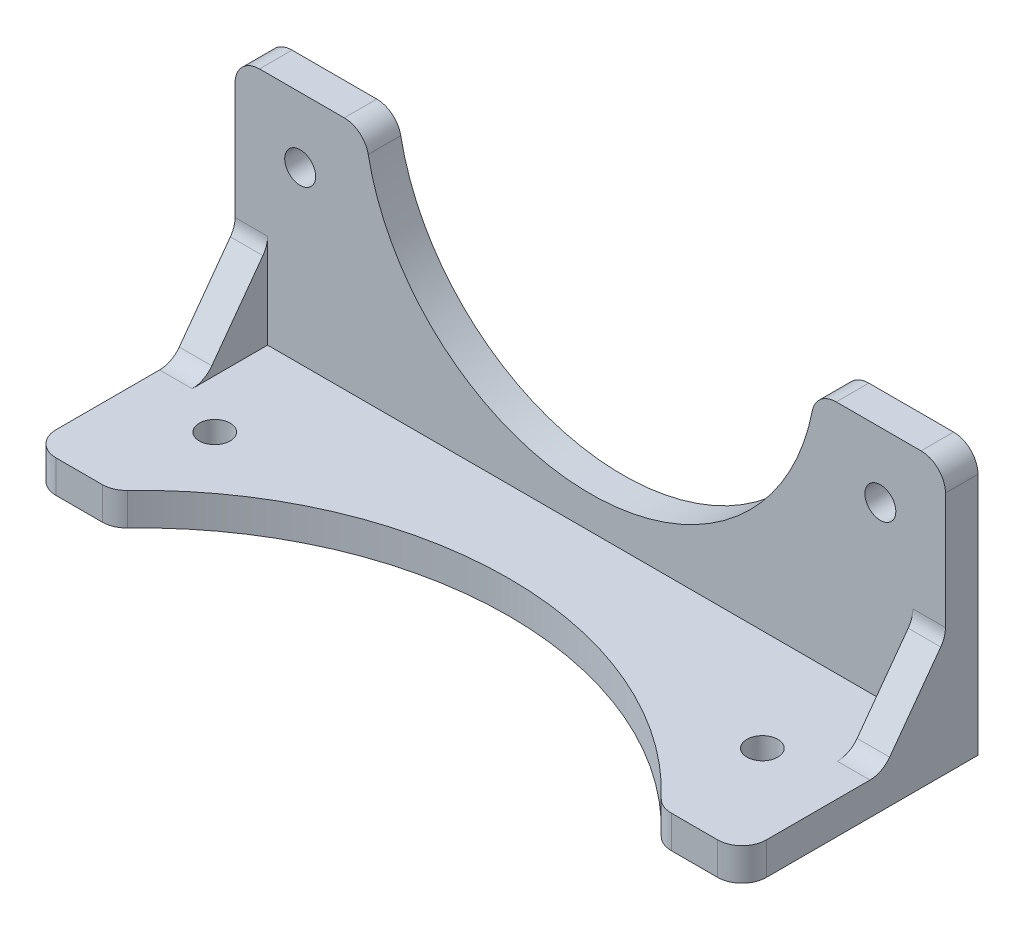
ISO-10303-21;
HEADER;
FILE_DESCRIPTION(('STEP AP214'),'2;1');
FILE_NAME('part.step','',(''),(''),'','','');
FILE_SCHEMA(('AUTOMOTIVE_DESIGN { 1 0 10303 214 1 1 1 1 }'));
ENDSEC;
DATA;
#1=APPLICATION_CONTEXT('core data for automotive mechanical design processes');
#2=APPLICATION_PROTOCOL_DEFINITION('international standard','automotive_design',2000,#1);
#3=PRODUCT_CONTEXT('',#1,'mechanical');
#4=PRODUCT('Part','Part','',(#3));
#5=PRODUCT_RELATED_PRODUCT_CATEGORY('part','',(#4));
#6=PRODUCT_DEFINITION_FORMATION('','',#4);
#7=PRODUCT_DEFINITION_CONTEXT('part definition',#1,'design');
#8=PRODUCT_DEFINITION('design','',#6,#7);
#9=PRODUCT_DEFINITION_SHAPE('','',#8);
#10=(LENGTH_UNIT() NAMED_UNIT(*) SI_UNIT(.MILLI.,.METRE.));
#11=(NAMED_UNIT(*) PLANE_ANGLE_UNIT() SI_UNIT($,.RADIAN.));
#12=(NAMED_UNIT(*) SI_UNIT($,.STERADIAN.) SOLID_ANGLE_UNIT());
#13=UNCERTAINTY_MEASURE_WITH_UNIT(LENGTH_MEASURE(1.E-05),#10,'distance_accuracy_value','');
#14=(GEOMETRIC_REPRESENTATION_CONTEXT(3) GLOBAL_UNCERTAINTY_ASSIGNED_CONTEXT((#13)) GLOBAL_UNIT_ASSIGNED_CONTEXT((#10,
#11,#12)) REPRESENTATION_CONTEXT('',''));
#15=CARTESIAN_POINT('',(0.,0.,0.));
#16=DIRECTION('',(0.,0.,1.));
#17=DIRECTION('',(1.,0.,0.));
#18=AXIS2_PLACEMENT_3D('',#15,#16,#17);
#19=CARTESIAN_POINT('',(0.,7.68566769527791,4.));
#20=DIRECTION('',(0.,0.,1.));
#21=DIRECTION('',(1.,0.,0.));
#22=AXIS2_PLACEMENT_3D('',#19,#20,#21);
#23=PLANE('',#22);
#24=CARTESIAN_POINT('',(35.65,-3.21618973444082,4.));
#25=DIRECTION('',(0.,0.,1.));
#26=DIRECTION('',(1.,0.,0.));
#27=AXIS2_PLACEMENT_3D('',#24,#25,#26);
#28=CIRCLE('',#27,1.9);
#29=CARTESIAN_POINT('',(37.55,-3.21618973444082,4.));
#30=VERTEX_POINT('',#29);
#31=EDGE_CURVE('E273',#30,#30,#28,.T.);
#32=ORIENTED_EDGE('',*,*,#31,.F.);
#33=EDGE_LOOP('',(#32));
#34=FACE_BOUND('',#33,.T.);
#35=CARTESIAN_POINT('',(-35.65,-3.21618973444082,4.));
#36=DIRECTION('',(0.,0.,1.));
#37=DIRECTION('',(1.,0.,0.));
#38=AXIS2_PLACEMENT_3D('',#35,#36,#37);
#39=CIRCLE('',#38,1.9);
#40=CARTESIAN_POINT('',(-33.75,-3.21618973444082,4.));
#41=VERTEX_POINT('',#40);
#42=EDGE_CURVE('E267',#41,#41,#39,.T.);
#43=ORIENTED_EDGE('',*,*,#42,.F.);
#44=EDGE_LOOP('',(#43));
#45=FACE_BOUND('',#44,.T.);
#46=DIRECTION('',(0.,-1.,0.));
#47=VECTOR('',#46,1.);
#48=CARTESIAN_POINT('',(-43.65,-28.116189734441,4.));
#49=LINE('',#48,#47);
#50=CARTESIAN_POINT('',(-43.65,1.78381026555919,4.));
#51=VERTEX_POINT('',#50);
#52=CARTESIAN_POINT('',(-43.65,-12.531005960223,4.));
#53=VERTEX_POINT('',#52);
#54=EDGE_CURVE('E292',#51,#53,#49,.T.);
#55=ORIENTED_EDGE('',*,*,#54,.T.);
#56=DIRECTION('',(-1.,0.,0.));
#57=VECTOR('',#56,1.);
#58=CARTESIAN_POINT('',(0.,-12.531005960223,4.));
#59=LINE('',#58,#57);
#60=CARTESIAN_POINT('',(-39.65,-12.531005960223,4.));
#61=VERTEX_POINT('',#60);
#62=EDGE_CURVE('E227',#53,#61,#59,.F.);
#63=ORIENTED_EDGE('',*,*,#62,.T.);
#64=DIRECTION('',(0.,1.,0.));
#65=VECTOR('',#64,1.);
#66=CARTESIAN_POINT('',(-39.65,-13.5109648216627,4.));
#67=LINE('',#66,#65);
#68=CARTESIAN_POINT('',(-39.65,-24.116189734441,4.));
#69=VERTEX_POINT('',#68);
#70=EDGE_CURVE('E211',#69,#61,#67,.T.);
#71=ORIENTED_EDGE('',*,*,#70,.F.);
#72=DIRECTION('',(1.,0.,0.));
#73=VECTOR('',#72,1.);
#74=CARTESIAN_POINT('',(-43.65,-24.116189734441,4.));
#75=LINE('',#74,#73);
#76=CARTESIAN_POINT('',(39.65,-24.116189734441,4.));
#77=VERTEX_POINT('',#76);
#78=EDGE_CURVE('E224',#69,#77,#75,.T.);
#79=ORIENTED_EDGE('',*,*,#78,.T.);
#80=DIRECTION('',(0.,1.,0.));
#81=VECTOR('',#80,1.);
#82=CARTESIAN_POINT('',(39.65,-13.5109648216627,4.));
#83=LINE('',#82,#81);
#84=CARTESIAN_POINT('',(39.65,-12.531005960223,4.));
#85=VERTEX_POINT('',#84);
#86=EDGE_CURVE('E258',#77,#85,#83,.T.);
#87=ORIENTED_EDGE('',*,*,#86,.T.);
#88=DIRECTION('',(1.,0.,0.));
#89=VECTOR('',#88,1.);
#90=CARTESIAN_POINT('',(43.65,-12.531005960223,4.));
#91=LINE('',#90,#89);
#92=CARTESIAN_POINT('',(43.65,-12.531005960223,4.));
#93=VERTEX_POINT('',#92);
#94=EDGE_CURVE('E327',#85,#93,#91,.T.);
#95=ORIENTED_EDGE('',*,*,#94,.T.);
#96=DIRECTION('',(0.,1.,0.));
#97=VECTOR('',#96,1.);
#98=CARTESIAN_POINT('',(43.65,4.78381026555919,4.));
#99=LINE('',#98,#97);
#100=CARTESIAN_POINT('',(43.65,1.78381026555919,4.));
#101=VERTEX_POINT('',#100);
#102=EDGE_CURVE('E279',#93,#101,#99,.T.);
#103=ORIENTED_EDGE('',*,*,#102,.T.);
#104=CARTESIAN_POINT('',(40.65,1.78381026555919,4.));
#105=DIRECTION('',(0.,0.,1.));
#106=DIRECTION('',(1.,0.,0.));
#107=AXIS2_PLACEMENT_3D('',#104,#105,#106);
#108=CIRCLE('',#107,3.);
#109=CARTESIAN_POINT('',(40.65,4.78381026555919,4.));
#110=VERTEX_POINT('',#109);
#111=EDGE_CURVE('E325',#101,#110,#108,.T.);
#112=ORIENTED_EDGE('',*,*,#111,.T.);
#113=DIRECTION('',(-1.,0.,0.));
#114=VECTOR('',#113,1.);
#115=CARTESIAN_POINT('',(27.65,4.78381026555919,4.));
#116=LINE('',#115,#114);
#117=CARTESIAN_POINT('',(30.2311511524123,4.78381026555919,4.));
#118=VERTEX_POINT('',#117);
#119=EDGE_CURVE('E282',#110,#118,#116,.T.);
#120=ORIENTED_EDGE('',*,*,#119,.T.);
#121=CARTESIAN_POINT('',(30.2311511524123,1.78381026555919,4.));
#122=DIRECTION('',(0.,0.,1.));
#123=DIRECTION('',(1.,0.,0.));
#124=AXIS2_PLACEMENT_3D('',#121,#122,#123);
#125=CIRCLE('',#124,3.);
#126=CARTESIAN_POINT('',(27.2867360740628,2.35863184343173,4.));
#127=VERTEX_POINT('',#126);
#128=EDGE_CURVE('E323',#118,#127,#125,.T.);
#129=ORIENTED_EDGE('',*,*,#128,.T.);
#130=CARTESIAN_POINT('',(0.,7.68566769527791,4.));
#131=DIRECTION('',(0.,0.,-1.));
#132=DIRECTION('',(1.,0.,0.));
#133=AXIS2_PLACEMENT_3D('',#130,#131,#132);
#134=CIRCLE('',#133,27.8018574297189);
#135=CARTESIAN_POINT('',(-27.2867360740628,2.35863184343173,4.));
#136=VERTEX_POINT('',#135);
#137=EDGE_CURVE('E286',#127,#136,#134,.T.);
#138=ORIENTED_EDGE('',*,*,#137,.T.);
#139=CARTESIAN_POINT('',(-30.2311511524123,1.78381026555919,4.));
#140=DIRECTION('',(0.,0.,1.));
#141=DIRECTION('',(1.,0.,0.));
#142=AXIS2_PLACEMENT_3D('',#139,#140,#141);
#143=CIRCLE('',#142,3.);
#144=CARTESIAN_POINT('',(-30.2311511524123,4.78381026555919,4.));
#145=VERTEX_POINT('',#144);
#146=EDGE_CURVE('E321',#136,#145,#143,.T.);
#147=ORIENTED_EDGE('',*,*,#146,.T.);
#148=DIRECTION('',(-1.,0.,0.));
#149=VECTOR('',#148,1.);
#150=CARTESIAN_POINT('',(-43.65,4.78381026555919,4.));
#151=LINE('',#150,#149);
#152=CARTESIAN_POINT('',(-40.65,4.78381026555919,4.));
#153=VERTEX_POINT('',#152);
#154=EDGE_CURVE('E289',#145,#153,#151,.T.);
#155=ORIENTED_EDGE('',*,*,#154,.T.);
#156=CARTESIAN_POINT('',(-40.65,1.78381026555919,4.));
#157=DIRECTION('',(0.,0.,1.));
#158=DIRECTION('',(1.,0.,0.));
#159=AXIS2_PLACEMENT_3D('',#156,#157,#158);
#160=CIRCLE('',#159,3.);
#161=EDGE_CURVE('E319',#153,#51,#160,.T.);
#162=ORIENTED_EDGE('',*,*,#161,.T.);
#163=EDGE_LOOP('',(#55,#63,#71,#79,#87,#95,#103,#112,#120,#129,#138,#147,#155,#162));
#164=FACE_BOUND('',#163,.T.);
#165=ADVANCED_FACE('F34',(#34,#45,#164),#23,.T.);
#166=CARTESIAN_POINT('',(0.,-24.116189734441,59.2440833333333));
#167=DIRECTION('',(0.,-1.,0.));
#168=DIRECTION('',(1.,0.,0.));
#169=AXIS2_PLACEMENT_3D('',#166,#167,#168);
#170=PLANE('',#169);
#171=CARTESIAN_POINT('',(-33.65,-24.116189734441,16.5));
#172=DIRECTION('',(0.,-1.,0.));
#173=DIRECTION('',(1.,0.,0.));
#174=AXIS2_PLACEMENT_3D('',#171,#172,#173);
#175=CIRCLE('',#174,1.90000000000001);
#176=CARTESIAN_POINT('',(-31.75,-24.116189734441,16.5));
#177=VERTEX_POINT('',#176);
#178=EDGE_CURVE('E252',#177,#177,#175,.T.);
#179=ORIENTED_EDGE('',*,*,#178,.T.);
#180=EDGE_LOOP('',(#179));
#181=FACE_BOUND('',#180,.T.);
#182=CARTESIAN_POINT('',(33.65,-24.116189734441,16.5));
#183=DIRECTION('',(0.,-1.,0.));
#184=DIRECTION('',(1.,0.,0.));
#185=AXIS2_PLACEMENT_3D('',#182,#183,#184);
#186=CIRCLE('',#185,1.90000000000001);
#187=CARTESIAN_POINT('',(35.55,-24.116189734441,16.5));
#188=VERTEX_POINT('',#187);
#189=EDGE_CURVE('E495',#188,#188,#186,.T.);
#190=ORIENTED_EDGE('',*,*,#189,.T.);
#191=EDGE_LOOP('',(#190));
#192=FACE_BOUND('',#191,.T.);
#193=DIRECTION('',(0.,0.,-1.));
#194=VECTOR('',#193,1.);
#195=CARTESIAN_POINT('',(-39.65,-24.116189734441,4.));
#196=LINE('',#195,#194);
#197=CARTESIAN_POINT('',(-39.65,-24.116189734441,13.2787023295618));
#198=VERTEX_POINT('',#197);
#199=EDGE_CURVE('E208',#198,#69,#196,.T.);
#200=ORIENTED_EDGE('',*,*,#199,.F.);
#201=DIRECTION('',(-1.,0.,0.));
#202=VECTOR('',#201,1.);
#203=CARTESIAN_POINT('',(-43.65,-24.116189734441,13.2787023295618));
#204=LINE('',#203,#202);
#205=CARTESIAN_POINT('',(-43.65,-24.116189734441,13.2787023295618));
#206=VERTEX_POINT('',#205);
#207=EDGE_CURVE('E341',#198,#206,#204,.T.);
#208=ORIENTED_EDGE('',*,*,#207,.T.);
#209=DIRECTION('',(0.,0.,-1.));
#210=VECTOR('',#209,1.);
#211=CARTESIAN_POINT('',(-43.65,-24.116189734441,29.));
#212=LINE('',#211,#210);
#213=CARTESIAN_POINT('',(-43.65,-24.116189734441,26.));
#214=VERTEX_POINT('',#213);
#215=EDGE_CURVE('E236',#214,#206,#212,.T.);
#216=ORIENTED_EDGE('',*,*,#215,.F.);
#217=CARTESIAN_POINT('',(-40.65,-24.116189734441,26.));
#218=DIRECTION('',(0.,-1.,0.));
#219=DIRECTION('',(1.,0.,0.));
#220=AXIS2_PLACEMENT_3D('',#217,#218,#219);
#221=CIRCLE('',#220,3.);
#222=CARTESIAN_POINT('',(-40.65,-24.116189734441,29.));
#223=VERTEX_POINT('',#222);
#224=EDGE_CURVE('E331',#214,#223,#221,.F.);
#225=ORIENTED_EDGE('',*,*,#224,.T.);
#226=DIRECTION('',(-1.,0.,0.));
#227=VECTOR('',#226,1.);
#228=CARTESIAN_POINT('',(-33.65,-24.116189734441,29.));
#229=LINE('',#228,#227);
#230=CARTESIAN_POINT('',(-34.9617290762342,-24.116189734441,29.));
#231=VERTEX_POINT('',#230);
#232=EDGE_CURVE('E242',#231,#223,#229,.T.);
#233=ORIENTED_EDGE('',*,*,#232,.F.);
#234=CARTESIAN_POINT('',(-34.9617290762342,-24.116189734441,26.));
#235=DIRECTION('',(0.,-1.,0.));
#236=DIRECTION('',(1.,0.,0.));
#237=AXIS2_PLACEMENT_3D('',#234,#235,#236);
#238=CIRCLE('',#237,3.);
#239=CARTESIAN_POINT('',(-32.7876762187259,-24.116189734441,28.0672431334412));
#240=VERTEX_POINT('',#239);
#241=EDGE_CURVE('E333',#231,#240,#238,.F.);
#242=ORIENTED_EDGE('',*,*,#241,.T.);
#243=CARTESIAN_POINT('',(0.,-24.116189734441,59.2440833333333));
#244=DIRECTION('',(0.,1.,0.));
#245=DIRECTION('',(1.,0.,0.));
#246=AXIS2_PLACEMENT_3D('',#243,#244,#245);
#247=CIRCLE('',#246,45.2440833333333);
#248=CARTESIAN_POINT('',(32.7876762187259,-24.116189734441,28.0672431334413));
#249=VERTEX_POINT('',#248);
#250=EDGE_CURVE('E257',#249,#240,#247,.T.);
#251=ORIENTED_EDGE('',*,*,#250,.F.);
#252=CARTESIAN_POINT('',(34.9617290762342,-24.116189734441,26.));
#253=DIRECTION('',(0.,-1.,0.));
#254=DIRECTION('',(1.,0.,0.));
#255=AXIS2_PLACEMENT_3D('',#252,#253,#254);
#256=CIRCLE('',#255,3.);
#257=CARTESIAN_POINT('',(34.9617290762342,-24.116189734441,29.));
#258=VERTEX_POINT('',#257);
#259=EDGE_CURVE('E335',#249,#258,#256,.F.);
#260=ORIENTED_EDGE('',*,*,#259,.T.);
#261=DIRECTION('',(-1.,0.,0.));
#262=VECTOR('',#261,1.);
#263=CARTESIAN_POINT('',(43.65,-24.116189734441,29.));
#264=LINE('',#263,#262);
#265=CARTESIAN_POINT('',(40.65,-24.116189734441,29.));
#266=VERTEX_POINT('',#265);
#267=EDGE_CURVE('E239',#266,#258,#264,.T.);
#268=ORIENTED_EDGE('',*,*,#267,.F.);
#269=CARTESIAN_POINT('',(40.65,-24.116189734441,26.));
#270=DIRECTION('',(0.,-1.,0.));
#271=DIRECTION('',(1.,0.,0.));
#272=AXIS2_PLACEMENT_3D('',#269,#270,#271);
#273=CIRCLE('',#272,3.);
#274=CARTESIAN_POINT('',(43.65,-24.116189734441,26.));
#275=VERTEX_POINT('',#274);
#276=EDGE_CURVE('E337',#266,#275,#273,.F.);
#277=ORIENTED_EDGE('',*,*,#276,.T.);
#278=DIRECTION('',(0.,0.,1.));
#279=VECTOR('',#278,1.);
#280=CARTESIAN_POINT('',(43.65,-24.116189734441,4.));
#281=LINE('',#280,#279);
#282=CARTESIAN_POINT('',(43.65,-24.116189734441,13.2787023295618));
#283=VERTEX_POINT('',#282);
#284=EDGE_CURVE('E235',#283,#275,#281,.T.);
#285=ORIENTED_EDGE('',*,*,#284,.F.);
#286=DIRECTION('',(1.,0.,0.));
#287=VECTOR('',#286,1.);
#288=CARTESIAN_POINT('',(0.,-24.116189734441,13.2787023295618));
#289=LINE('',#288,#287);
#290=CARTESIAN_POINT('',(39.65,-24.116189734441,13.2787023295618));
#291=VERTEX_POINT('',#290);
#292=EDGE_CURVE('E339',#283,#291,#289,.F.);
#293=ORIENTED_EDGE('',*,*,#292,.T.);
#294=DIRECTION('',(0.,0.,-1.));
#295=VECTOR('',#294,1.);
#296=CARTESIAN_POINT('',(39.65,-24.116189734441,4.));
#297=LINE('',#296,#295);
#298=EDGE_CURVE('E234',#291,#77,#297,.T.);
#299=ORIENTED_EDGE('',*,*,#298,.T.);
#300=ORIENTED_EDGE('',*,*,#78,.F.);
#301=EDGE_LOOP('',(#200,#208,#216,#225,#233,#242,#251,#260,#268,#277,#285,#293,#299,#300));
#302=FACE_BOUND('',#301,.T.);
#303=ADVANCED_FACE('F232',(#181,#192,#302),#170,.F.);
#304=CARTESIAN_POINT('',(0.,7.68566769527791,0.));
#305=DIRECTION('',(0.,0.,1.));
#306=DIRECTION('',(1.,0.,0.));
#307=AXIS2_PLACEMENT_3D('',#304,#305,#306);
#308=PLANE('',#307);
#309=DIRECTION('',(-1.,0.,0.));
#310=VECTOR('',#309,1.);
#311=CARTESIAN_POINT('',(27.65,4.78381026555919,0.));
#312=LINE('',#311,#310);
#313=CARTESIAN_POINT('',(40.65,4.78381026555919,0.));
#314=VERTEX_POINT('',#313);
#315=CARTESIAN_POINT('',(30.2311511524123,4.78381026555919,0.));
#316=VERTEX_POINT('',#315);
#317=EDGE_CURVE('E300',#314,#316,#312,.T.);
#318=ORIENTED_EDGE('',*,*,#317,.F.);
#319=CARTESIAN_POINT('',(40.65,1.78381026555919,0.));
#320=DIRECTION('',(0.,0.,1.));
#321=DIRECTION('',(1.,0.,0.));
#322=AXIS2_PLACEMENT_3D('',#319,#320,#321);
#323=CIRCLE('',#322,3.);
#324=CARTESIAN_POINT('',(43.65,1.78381026555919,0.));
#325=VERTEX_POINT('',#324);
#326=EDGE_CURVE('E359',#314,#325,#323,.F.);
#327=ORIENTED_EDGE('',*,*,#326,.T.);
#328=DIRECTION('',(0.,1.,0.));
#329=VECTOR('',#328,1.);
#330=CARTESIAN_POINT('',(43.65,4.78381026555919,0.));
#331=LINE('',#330,#329);
#332=CARTESIAN_POINT('',(43.65,-28.116189734441,0.));
#333=VERTEX_POINT('',#332);
#334=EDGE_CURVE('E297',#333,#325,#331,.T.);
#335=ORIENTED_EDGE('',*,*,#334,.F.);
#336=DIRECTION('',(1.,0.,0.));
#337=VECTOR('',#336,1.);
#338=CARTESIAN_POINT('',(43.65,-28.116189734441,0.));
#339=LINE('',#338,#337);
#340=CARTESIAN_POINT('',(-43.65,-28.116189734441,0.));
#341=VERTEX_POINT('',#340);
#342=EDGE_CURVE('E276',#341,#333,#339,.T.);
#343=ORIENTED_EDGE('',*,*,#342,.F.);
#344=DIRECTION('',(0.,-1.,0.));
#345=VECTOR('',#344,1.);
#346=CARTESIAN_POINT('',(-43.65,-28.116189734441,0.));
#347=LINE('',#346,#345);
#348=CARTESIAN_POINT('',(-43.65,1.78381026555919,0.));
#349=VERTEX_POINT('',#348);
#350=EDGE_CURVE('E283',#349,#341,#347,.T.);
#351=ORIENTED_EDGE('',*,*,#350,.F.);
#352=CARTESIAN_POINT('',(-40.65,1.78381026555919,0.));
#353=DIRECTION('',(0.,0.,1.));
#354=DIRECTION('',(1.,0.,0.));
#355=AXIS2_PLACEMENT_3D('',#352,#353,#354);
#356=CIRCLE('',#355,3.);
#357=CARTESIAN_POINT('',(-40.65,4.78381026555919,0.));
#358=VERTEX_POINT('',#357);
#359=EDGE_CURVE('E353',#349,#358,#356,.F.);
#360=ORIENTED_EDGE('',*,*,#359,.T.);
#361=DIRECTION('',(-1.,0.,0.));
#362=VECTOR('',#361,1.);
#363=CARTESIAN_POINT('',(-43.65,4.78381026555919,0.));
#364=LINE('',#363,#362);
#365=CARTESIAN_POINT('',(-30.2311511524123,4.78381026555919,0.));
#366=VERTEX_POINT('',#365);
#367=EDGE_CURVE('E306',#366,#358,#364,.T.);
#368=ORIENTED_EDGE('',*,*,#367,.F.);
#369=CARTESIAN_POINT('',(-30.2311511524123,1.78381026555919,0.));
#370=DIRECTION('',(0.,0.,1.));
#371=DIRECTION('',(1.,0.,0.));
#372=AXIS2_PLACEMENT_3D('',#369,#370,#371);
#373=CIRCLE('',#372,3.);
#374=CARTESIAN_POINT('',(-27.2867360740628,2.35863184343173,0.));
#375=VERTEX_POINT('',#374);
#376=EDGE_CURVE('E355',#366,#375,#373,.F.);
#377=ORIENTED_EDGE('',*,*,#376,.T.);
#378=CARTESIAN_POINT('',(0.,7.68566769527791,0.));
#379=DIRECTION('',(0.,0.,-1.));
#380=DIRECTION('',(1.,0.,0.));
#381=AXIS2_PLACEMENT_3D('',#378,#379,#380);
#382=CIRCLE('',#381,27.8018574297189);
#383=CARTESIAN_POINT('',(27.2867360740628,2.35863184343173,0.));
#384=VERTEX_POINT('',#383);
#385=EDGE_CURVE('E303',#384,#375,#382,.T.);
#386=ORIENTED_EDGE('',*,*,#385,.F.);
#387=CARTESIAN_POINT('',(30.2311511524123,1.78381026555919,0.));
#388=DIRECTION('',(0.,0.,1.));
#389=DIRECTION('',(1.,0.,0.));
#390=AXIS2_PLACEMENT_3D('',#387,#388,#389);
#391=CIRCLE('',#390,3.);
#392=EDGE_CURVE('E357',#384,#316,#391,.F.);
#393=ORIENTED_EDGE('',*,*,#392,.T.);
#394=EDGE_LOOP('',(#318,#327,#335,#343,#351,#360,#368,#377,#386,#393));
#395=FACE_BOUND('',#394,.T.);
#396=CARTESIAN_POINT('',(35.65,-3.21618973444082,0.));
#397=DIRECTION('',(0.,0.,1.));
#398=DIRECTION('',(1.,0.,0.));
#399=AXIS2_PLACEMENT_3D('',#396,#397,#398);
#400=CIRCLE('',#399,1.9);
#401=CARTESIAN_POINT('',(37.55,-3.21618973444082,0.));
#402=VERTEX_POINT('',#401);
#403=EDGE_CURVE('E270',#402,#402,#400,.T.);
#404=ORIENTED_EDGE('',*,*,#403,.T.);
#405=EDGE_LOOP('',(#404));
#406=FACE_BOUND('',#405,.T.);
#407=CARTESIAN_POINT('',(-35.65,-3.21618973444082,0.));
#408=DIRECTION('',(0.,0.,1.));
#409=DIRECTION('',(1.,0.,0.));
#410=AXIS2_PLACEMENT_3D('',#407,#408,#409);
#411=CIRCLE('',#410,1.9);
#412=CARTESIAN_POINT('',(-33.75,-3.21618973444082,0.));
#413=VERTEX_POINT('',#412);
#414=EDGE_CURVE('E264',#413,#413,#411,.T.);
#415=ORIENTED_EDGE('',*,*,#414,.T.);
#416=EDGE_LOOP('',(#415));
#417=FACE_BOUND('',#416,.T.);
#418=ADVANCED_FACE('F447',(#395,#406,#417),#308,.F.);
#419=CARTESIAN_POINT('',(43.65,-28.116189734441,4.));
#420=DIRECTION('',(0.,1.,0.));
#421=DIRECTION('',(0.,0.,1.));
#422=AXIS2_PLACEMENT_3D('',#419,#420,#421);
#423=PLANE('',#422);
#424=DIRECTION('',(0.,0.,-1.));
#425=VECTOR('',#424,1.);
#426=CARTESIAN_POINT('',(43.65,-28.116189734441,4.));
#427=LINE('',#426,#425);
#428=CARTESIAN_POINT('',(43.65,-28.116189734441,26.));
#429=VERTEX_POINT('',#428);
#430=EDGE_CURVE('E312',#429,#333,#427,.T.);
#431=ORIENTED_EDGE('',*,*,#430,.F.);
#432=CARTESIAN_POINT('',(40.65,-28.116189734441,26.));
#433=DIRECTION('',(0.,1.,0.));
#434=DIRECTION('',(0.,0.,1.));
#435=AXIS2_PLACEMENT_3D('',#432,#433,#434);
#436=CIRCLE('',#435,3.);
#437=CARTESIAN_POINT('',(40.65,-28.116189734441,29.));
#438=VERTEX_POINT('',#437);
#439=EDGE_CURVE('E385',#429,#438,#436,.F.);
#440=ORIENTED_EDGE('',*,*,#439,.T.);
#441=DIRECTION('',(-1.,0.,0.));
#442=VECTOR('',#441,1.);
#443=CARTESIAN_POINT('',(43.65,-28.116189734441,29.));
#444=LINE('',#443,#442);
#445=CARTESIAN_POINT('',(34.9617290762342,-28.116189734441,29.));
#446=VERTEX_POINT('',#445);
#447=EDGE_CURVE('E254',#438,#446,#444,.T.);
#448=ORIENTED_EDGE('',*,*,#447,.T.);
#449=CARTESIAN_POINT('',(34.9617290762342,-28.116189734441,26.));
#450=DIRECTION('',(0.,1.,0.));
#451=DIRECTION('',(0.,0.,1.));
#452=AXIS2_PLACEMENT_3D('',#449,#450,#451);
#453=CIRCLE('',#452,3.);
#454=CARTESIAN_POINT('',(32.7876762187259,-28.116189734441,28.0672431334413));
#455=VERTEX_POINT('',#454);
#456=EDGE_CURVE('E383',#446,#455,#453,.F.);
#457=ORIENTED_EDGE('',*,*,#456,.T.);
#458=CARTESIAN_POINT('',(0.,-28.116189734441,59.2440833333333));
#459=DIRECTION('',(0.,1.,0.));
#460=DIRECTION('',(1.,0.,0.));
#461=AXIS2_PLACEMENT_3D('',#458,#459,#460);
#462=CIRCLE('',#461,45.2440833333333);
#463=CARTESIAN_POINT('',(-32.7876762187259,-28.116189734441,28.0672431334412));
#464=VERTEX_POINT('',#463);
#465=EDGE_CURVE('E249',#455,#464,#462,.T.);
#466=ORIENTED_EDGE('',*,*,#465,.T.);
#467=CARTESIAN_POINT('',(-34.9617290762342,-28.116189734441,26.));
#468=DIRECTION('',(0.,1.,0.));
#469=DIRECTION('',(0.,0.,1.));
#470=AXIS2_PLACEMENT_3D('',#467,#468,#469);
#471=CIRCLE('',#470,3.);
#472=CARTESIAN_POINT('',(-34.9617290762342,-28.116189734441,29.));
#473=VERTEX_POINT('',#472);
#474=EDGE_CURVE('E57',#464,#473,#471,.F.);
#475=ORIENTED_EDGE('',*,*,#474,.T.);
#476=DIRECTION('',(-1.,0.,0.));
#477=VECTOR('',#476,1.);
#478=CARTESIAN_POINT('',(-33.65,-28.116189734441,29.));
#479=LINE('',#478,#477);
#480=CARTESIAN_POINT('',(-40.65,-28.116189734441,29.));
#481=VERTEX_POINT('',#480);
#482=EDGE_CURVE('E251',#473,#481,#479,.T.);
#483=ORIENTED_EDGE('',*,*,#482,.T.);
#484=CARTESIAN_POINT('',(-40.65,-28.116189734441,26.));
#485=DIRECTION('',(0.,1.,0.));
#486=DIRECTION('',(0.,0.,1.));
#487=AXIS2_PLACEMENT_3D('',#484,#485,#486);
#488=CIRCLE('',#487,3.);
#489=CARTESIAN_POINT('',(-43.65,-28.116189734441,26.));
#490=VERTEX_POINT('',#489);
#491=EDGE_CURVE('E49',#481,#490,#488,.F.);
#492=ORIENTED_EDGE('',*,*,#491,.T.);
#493=DIRECTION('',(0.,0.,-1.));
#494=VECTOR('',#493,1.);
#495=CARTESIAN_POINT('',(-43.65,-28.116189734441,4.));
#496=LINE('',#495,#494);
#497=EDGE_CURVE('E294',#490,#341,#496,.T.);
#498=ORIENTED_EDGE('',*,*,#497,.T.);
#499=ORIENTED_EDGE('',*,*,#342,.T.);
#500=EDGE_LOOP('',(#431,#440,#448,#457,#466,#475,#483,#492,#498,#499));
#501=FACE_BOUND('',#500,.T.);
#502=CARTESIAN_POINT('',(33.65,-28.116189734441,16.5));
#503=DIRECTION('',(0.,-1.,0.));
#504=DIRECTION('',(1.,0.,0.));
#505=AXIS2_PLACEMENT_3D('',#502,#503,#504);
#506=CIRCLE('',#505,1.90000000000001);
#507=CARTESIAN_POINT('',(35.55,-28.116189734441,16.5));
#508=VERTEX_POINT('',#507);
#509=EDGE_CURVE('E492',#508,#508,#506,.T.);
#510=ORIENTED_EDGE('',*,*,#509,.F.);
#511=EDGE_LOOP('',(#510));
#512=FACE_BOUND('',#511,.T.);
#513=CARTESIAN_POINT('',(-33.65,-28.116189734441,16.5));
#514=DIRECTION('',(0.,-1.,0.));
#515=DIRECTION('',(1.,0.,0.));
#516=AXIS2_PLACEMENT_3D('',#513,#514,#515);
#517=CIRCLE('',#516,1.90000000000001);
#518=CARTESIAN_POINT('',(-31.75,-28.116189734441,16.5));
#519=VERTEX_POINT('',#518);
#520=EDGE_CURVE('E500',#519,#519,#517,.T.);
#521=ORIENTED_EDGE('',*,*,#520,.F.);
#522=EDGE_LOOP('',(#521));
#523=FACE_BOUND('',#522,.T.);
#524=ADVANCED_FACE('F439',(#501,#512,#523),#423,.F.);
#525=CARTESIAN_POINT('',(43.65,4.78381026555919,4.));
#526=DIRECTION('',(-1.,0.,0.));
#527=DIRECTION('',(0.,0.,1.));
#528=AXIS2_PLACEMENT_3D('',#525,#526,#527);
#529=PLANE('',#528);
#530=ORIENTED_EDGE('',*,*,#334,.T.);
#531=DIRECTION('',(0.,0.,-1.));
#532=VECTOR('',#531,1.);
#533=CARTESIAN_POINT('',(43.65,1.78381026555919,4.));
#534=LINE('',#533,#532);
#535=EDGE_CURVE('E364',#325,#101,#534,.F.);
#536=ORIENTED_EDGE('',*,*,#535,.T.);
#537=ORIENTED_EDGE('',*,*,#102,.F.);
#538=CARTESIAN_POINT('',(43.65,-12.531005960223,7.));
#539=DIRECTION('',(-1.,0.,0.));
#540=DIRECTION('',(0.,0.,1.));
#541=AXIS2_PLACEMENT_3D('',#538,#539,#540);
#542=CIRCLE('',#541,3.);
#543=CARTESIAN_POINT('',(43.65,-14.3019591646796,4.57848709530071));
#544=VERTEX_POINT('',#543);
#545=EDGE_CURVE('E42',#93,#544,#542,.T.);
#546=ORIENTED_EDGE('',*,*,#545,.T.);
#547=DIRECTION('',(0.,-0.807170968233096,0.59031773481884));
#548=VECTOR('',#547,1.);
#549=CARTESIAN_POINT('',(43.65,-24.116189734441,11.7560425165684));
#550=LINE('',#549,#548);
#551=CARTESIAN_POINT('',(43.65,-22.8871429388975,10.8571894248625));
#552=VERTEX_POINT('',#551);
#553=EDGE_CURVE('E248',#544,#552,#550,.T.);
#554=ORIENTED_EDGE('',*,*,#553,.T.);
#555=CARTESIAN_POINT('',(43.65,-21.116189734441,13.2787023295618));
#556=DIRECTION('',(-1.,0.,0.));
#557=DIRECTION('',(0.,0.,1.));
#558=AXIS2_PLACEMENT_3D('',#555,#556,#557);
#559=CIRCLE('',#558,3.);
#560=EDGE_CURVE('E408',#552,#283,#559,.T.);
#561=ORIENTED_EDGE('',*,*,#560,.T.);
#562=ORIENTED_EDGE('',*,*,#284,.T.);
#563=DIRECTION('',(0.,-1.,0.));
#564=VECTOR('',#563,1.);
#565=CARTESIAN_POINT('',(43.65,-28.116189734441,26.));
#566=LINE('',#565,#564);
#567=EDGE_CURVE('E361',#275,#429,#566,.T.);
#568=ORIENTED_EDGE('',*,*,#567,.T.);
#569=ORIENTED_EDGE('',*,*,#430,.T.);
#570=EDGE_LOOP('',(#530,#536,#537,#546,#554,#561,#562,#568,#569));
#571=FACE_BOUND('',#570,.T.);
#572=ADVANCED_FACE('F414',(#571),#529,.F.);
#573=CARTESIAN_POINT('',(27.65,4.78381026555919,4.));
#574=DIRECTION('',(0.,-1.,0.));
#575=DIRECTION('',(0.,0.,-1.));
#576=AXIS2_PLACEMENT_3D('',#573,#574,#575);
#577=PLANE('',#576);
#578=ORIENTED_EDGE('',*,*,#119,.F.);
#579=DIRECTION('',(0.,0.,-1.));
#580=VECTOR('',#579,1.);
#581=CARTESIAN_POINT('',(40.65,4.78381026555919,4.));
#582=LINE('',#581,#580);
#583=EDGE_CURVE('E350',#110,#314,#582,.T.);
#584=ORIENTED_EDGE('',*,*,#583,.T.);
#585=ORIENTED_EDGE('',*,*,#317,.T.);
#586=DIRECTION('',(0.,0.,-1.));
#587=VECTOR('',#586,1.);
#588=CARTESIAN_POINT('',(30.2311511524123,4.78381026555919,4.));
#589=LINE('',#588,#587);
#590=EDGE_CURVE('E348',#316,#118,#589,.F.);
#591=ORIENTED_EDGE('',*,*,#590,.T.);
#592=EDGE_LOOP('',(#578,#584,#585,#591));
#593=FACE_BOUND('',#592,.T.);
#594=ADVANCED_FACE('F457',(#593),#577,.F.);
#595=CARTESIAN_POINT('',(0.,7.68566769527791,4.));
#596=DIRECTION('',(0.,0.,-1.));
#597=DIRECTION('',(-1.,0.,0.));
#598=AXIS2_PLACEMENT_3D('',#595,#596,#597);
#599=CYLINDRICAL_SURFACE('',#598,27.8018574297189);
#600=ORIENTED_EDGE('',*,*,#137,.F.);
#601=DIRECTION('',(0.,0.,-1.));
#602=VECTOR('',#601,1.);
#603=CARTESIAN_POINT('',(27.2867360740628,2.35863184343173,4.));
#604=LINE('',#603,#602);
#605=EDGE_CURVE('E368',#127,#384,#604,.T.);
#606=ORIENTED_EDGE('',*,*,#605,.T.);
#607=ORIENTED_EDGE('',*,*,#385,.T.);
#608=DIRECTION('',(0.,0.,-1.));
#609=VECTOR('',#608,1.);
#610=CARTESIAN_POINT('',(-27.2867360740628,2.35863184343173,4.));
#611=LINE('',#610,#609);
#612=EDGE_CURVE('E366',#375,#136,#611,.F.);
#613=ORIENTED_EDGE('',*,*,#612,.T.);
#614=EDGE_LOOP('',(#600,#606,#607,#613));
#615=FACE_BOUND('',#614,.T.);
#616=ADVANCED_FACE('F465',(#615),#599,.F.);
#617=CARTESIAN_POINT('',(-43.65,4.78381026555919,4.));
#618=DIRECTION('',(0.,-1.,0.));
#619=DIRECTION('',(0.,0.,-1.));
#620=AXIS2_PLACEMENT_3D('',#617,#618,#619);
#621=PLANE('',#620);
#622=ORIENTED_EDGE('',*,*,#154,.F.);
#623=DIRECTION('',(0.,0.,-1.));
#624=VECTOR('',#623,1.);
#625=CARTESIAN_POINT('',(-30.2311511524123,4.78381026555919,4.));
#626=LINE('',#625,#624);
#627=EDGE_CURVE('E373',#145,#366,#626,.T.);
#628=ORIENTED_EDGE('',*,*,#627,.T.);
#629=ORIENTED_EDGE('',*,*,#367,.T.);
#630=DIRECTION('',(0.,0.,-1.));
#631=VECTOR('',#630,1.);
#632=CARTESIAN_POINT('',(-40.65,4.78381026555919,4.));
#633=LINE('',#632,#631);
#634=EDGE_CURVE('E371',#358,#153,#633,.F.);
#635=ORIENTED_EDGE('',*,*,#634,.T.);
#636=EDGE_LOOP('',(#622,#628,#629,#635));
#637=FACE_BOUND('',#636,.T.);
#638=ADVANCED_FACE('F474',(#637),#621,.F.);
#639=CARTESIAN_POINT('',(-43.65,-28.116189734441,4.));
#640=DIRECTION('',(1.,0.,0.));
#641=DIRECTION('',(0.,0.,-1.));
#642=AXIS2_PLACEMENT_3D('',#639,#640,#641);
#643=PLANE('',#642);
#644=ORIENTED_EDGE('',*,*,#54,.F.);
#645=DIRECTION('',(0.,0.,-1.));
#646=VECTOR('',#645,1.);
#647=CARTESIAN_POINT('',(-43.65,1.78381026555919,4.));
#648=LINE('',#647,#646);
#649=EDGE_CURVE('E378',#51,#349,#648,.T.);
#650=ORIENTED_EDGE('',*,*,#649,.T.);
#651=ORIENTED_EDGE('',*,*,#350,.T.);
#652=ORIENTED_EDGE('',*,*,#497,.F.);
#653=DIRECTION('',(0.,-1.,0.));
#654=VECTOR('',#653,1.);
#655=CARTESIAN_POINT('',(-43.65,-24.116189734441,26.));
#656=LINE('',#655,#654);
#657=EDGE_CURVE('E376',#490,#214,#656,.F.);
#658=ORIENTED_EDGE('',*,*,#657,.T.);
#659=ORIENTED_EDGE('',*,*,#215,.T.);
#660=CARTESIAN_POINT('',(-43.65,-21.116189734441,13.2787023295618));
#661=DIRECTION('',(1.,0.,0.));
#662=DIRECTION('',(0.,0.,-1.));
#663=AXIS2_PLACEMENT_3D('',#660,#661,#662);
#664=CIRCLE('',#663,3.);
#665=CARTESIAN_POINT('',(-43.65,-22.8871429388975,10.8571894248625));
#666=VERTEX_POINT('',#665);
#667=EDGE_CURVE('E405',#206,#666,#664,.T.);
#668=ORIENTED_EDGE('',*,*,#667,.T.);
#669=DIRECTION('',(0.,-0.807170968233096,0.59031773481884));
#670=VECTOR('',#669,1.);
#671=CARTESIAN_POINT('',(-43.65,-24.116189734441,11.7560425165684));
#672=LINE('',#671,#670);
#673=CARTESIAN_POINT('',(-43.65,-14.3019591646796,4.57848709530071));
#674=VERTEX_POINT('',#673);
#675=EDGE_CURVE('E229',#674,#666,#672,.T.);
#676=ORIENTED_EDGE('',*,*,#675,.F.);
#677=CARTESIAN_POINT('',(-43.65,-12.531005960223,7.));
#678=DIRECTION('',(1.,0.,0.));
#679=DIRECTION('',(0.,0.,-1.));
#680=AXIS2_PLACEMENT_3D('',#677,#678,#679);
#681=CIRCLE('',#680,3.);
#682=EDGE_CURVE('E401',#674,#53,#681,.T.);
#683=ORIENTED_EDGE('',*,*,#682,.T.);
#684=EDGE_LOOP('',(#644,#650,#651,#652,#658,#659,#668,#676,#683));
#685=FACE_BOUND('',#684,.T.);
#686=ADVANCED_FACE('F482',(#685),#643,.F.);
#687=CARTESIAN_POINT('',(35.65,-3.21618973444082,4.));
#688=DIRECTION('',(0.,0.,-1.));
#689=DIRECTION('',(-1.,0.,0.));
#690=AXIS2_PLACEMENT_3D('',#687,#688,#689);
#691=CYLINDRICAL_SURFACE('',#690,1.9);
#692=ORIENTED_EDGE('',*,*,#31,.T.);
#693=EDGE_LOOP('',(#692));
#694=FACE_BOUND('',#693,.T.);
#695=ORIENTED_EDGE('',*,*,#403,.F.);
#696=EDGE_LOOP('',(#695));
#697=FACE_BOUND('',#696,.T.);
#698=ADVANCED_FACE('F537',(#694,#697),#691,.F.);
#699=CARTESIAN_POINT('',(-35.65,-3.21618973444082,4.));
#700=DIRECTION('',(0.,0.,-1.));
#701=DIRECTION('',(-1.,0.,0.));
#702=AXIS2_PLACEMENT_3D('',#699,#700,#701);
#703=CYLINDRICAL_SURFACE('',#702,1.9);
#704=ORIENTED_EDGE('',*,*,#42,.T.);
#705=EDGE_LOOP('',(#704));
#706=FACE_BOUND('',#705,.T.);
#707=ORIENTED_EDGE('',*,*,#414,.F.);
#708=EDGE_LOOP('',(#707));
#709=FACE_BOUND('',#708,.T.);
#710=ADVANCED_FACE('F583',(#706,#709),#703,.F.);
#711=CARTESIAN_POINT('',(39.65,-24.116189734441,11.7560425165684));
#712=DIRECTION('',(0.,0.59031773481884,0.807170968233096));
#713=DIRECTION('',(0.,-0.807170968233096,0.59031773481884));
#714=AXIS2_PLACEMENT_3D('',#711,#712,#713);
#715=PLANE('',#714);
#716=DIRECTION('',(0.,-0.807170968233096,0.59031773481884));
#717=VECTOR('',#716,1.);
#718=CARTESIAN_POINT('',(39.65,-24.116189734441,11.7560425165684));
#719=LINE('',#718,#717);
#720=CARTESIAN_POINT('',(39.65,-14.3019591646796,4.57848709530071));
#721=VERTEX_POINT('',#720);
#722=CARTESIAN_POINT('',(39.65,-22.8871429388975,10.8571894248625));
#723=VERTEX_POINT('',#722);
#724=EDGE_CURVE('E260',#721,#723,#719,.T.);
#725=ORIENTED_EDGE('',*,*,#724,.T.);
#726=DIRECTION('',(1.,0.,0.));
#727=VECTOR('',#726,1.);
#728=CARTESIAN_POINT('',(39.65,-22.8871429388975,10.8571894248625));
#729=LINE('',#728,#727);
#730=EDGE_CURVE('E345',#723,#552,#729,.T.);
#731=ORIENTED_EDGE('',*,*,#730,.T.);
#732=ORIENTED_EDGE('',*,*,#553,.F.);
#733=DIRECTION('',(1.,0.,0.));
#734=VECTOR('',#733,1.);
#735=CARTESIAN_POINT('',(39.65,-14.3019591646796,4.57848709530071));
#736=LINE('',#735,#734);
#737=EDGE_CURVE('E343',#544,#721,#736,.F.);
#738=ORIENTED_EDGE('',*,*,#737,.T.);
#739=EDGE_LOOP('',(#725,#731,#732,#738));
#740=FACE_BOUND('',#739,.T.);
#741=ADVANCED_FACE('F419',(#740),#715,.T.);
#742=CARTESIAN_POINT('',(39.65,0.,0.));
#743=DIRECTION('',(-1.,0.,0.));
#744=DIRECTION('',(0.,0.,1.));
#745=AXIS2_PLACEMENT_3D('',#742,#743,#744);
#746=PLANE('',#745);
#747=ORIENTED_EDGE('',*,*,#86,.F.);
#748=ORIENTED_EDGE('',*,*,#298,.F.);
#749=CARTESIAN_POINT('',(39.65,-21.116189734441,13.2787023295618));
#750=DIRECTION('',(-1.,0.,0.));
#751=DIRECTION('',(0.,0.,1.));
#752=AXIS2_PLACEMENT_3D('',#749,#750,#751);
#753=CIRCLE('',#752,3.);
#754=EDGE_CURVE('E410',#291,#723,#753,.F.);
#755=ORIENTED_EDGE('',*,*,#754,.T.);
#756=ORIENTED_EDGE('',*,*,#724,.F.);
#757=CARTESIAN_POINT('',(39.65,-12.531005960223,7.));
#758=DIRECTION('',(-1.,0.,0.));
#759=DIRECTION('',(0.,0.,1.));
#760=AXIS2_PLACEMENT_3D('',#757,#758,#759);
#761=CIRCLE('',#760,3.);
#762=EDGE_CURVE('E11',#721,#85,#761,.F.);
#763=ORIENTED_EDGE('',*,*,#762,.T.);
#764=EDGE_LOOP('',(#747,#748,#755,#756,#763));
#765=FACE_BOUND('',#764,.T.);
#766=ADVANCED_FACE('F425',(#765),#746,.T.);
#767=CARTESIAN_POINT('',(0.,-24.116189734441,59.2440833333333));
#768=DIRECTION('',(0.,-1.,0.));
#769=DIRECTION('',(1.,0.,0.));
#770=AXIS2_PLACEMENT_3D('',#767,#768,#769);
#771=CYLINDRICAL_SURFACE('',#770,45.2440833333333);
#772=ORIENTED_EDGE('',*,*,#465,.F.);
#773=DIRECTION('',(0.,-1.,0.));
#774=VECTOR('',#773,1.);
#775=CARTESIAN_POINT('',(32.7876762187259,-24.116189734441,28.0672431334413));
#776=LINE('',#775,#774);
#777=EDGE_CURVE('E395',#455,#249,#776,.F.);
#778=ORIENTED_EDGE('',*,*,#777,.T.);
#779=ORIENTED_EDGE('',*,*,#250,.T.);
#780=DIRECTION('',(0.,-1.,0.));
#781=VECTOR('',#780,1.);
#782=CARTESIAN_POINT('',(-32.7876762187259,-24.116189734441,28.0672431334412));
#783=LINE('',#782,#781);
#784=EDGE_CURVE('E392',#240,#464,#783,.T.);
#785=ORIENTED_EDGE('',*,*,#784,.T.);
#786=EDGE_LOOP('',(#772,#778,#779,#785));
#787=FACE_BOUND('',#786,.T.);
#788=ADVANCED_FACE('F602',(#787),#771,.F.);
#789=CARTESIAN_POINT('',(43.65,-24.116189734441,29.));
#790=DIRECTION('',(0.,0.,1.));
#791=DIRECTION('',(1.,0.,0.));
#792=AXIS2_PLACEMENT_3D('',#789,#790,#791);
#793=PLANE('',#792);
#794=ORIENTED_EDGE('',*,*,#447,.F.);
#795=DIRECTION('',(0.,-1.,0.));
#796=VECTOR('',#795,1.);
#797=CARTESIAN_POINT('',(40.65,-24.116189734441,29.));
#798=LINE('',#797,#796);
#799=EDGE_CURVE('E390',#438,#266,#798,.F.);
#800=ORIENTED_EDGE('',*,*,#799,.T.);
#801=ORIENTED_EDGE('',*,*,#267,.T.);
#802=DIRECTION('',(0.,-1.,0.));
#803=VECTOR('',#802,1.);
#804=CARTESIAN_POINT('',(34.9617290762342,-24.116189734441,29.));
#805=LINE('',#804,#803);
#806=EDGE_CURVE('E387',#258,#446,#805,.T.);
#807=ORIENTED_EDGE('',*,*,#806,.T.);
#808=EDGE_LOOP('',(#794,#800,#801,#807));
#809=FACE_BOUND('',#808,.T.);
#810=ADVANCED_FACE('F609',(#809),#793,.T.);
#811=CARTESIAN_POINT('',(-33.65,-24.116189734441,29.));
#812=DIRECTION('',(0.,0.,1.));
#813=DIRECTION('',(1.,0.,0.));
#814=AXIS2_PLACEMENT_3D('',#811,#812,#813);
#815=PLANE('',#814);
#816=ORIENTED_EDGE('',*,*,#482,.F.);
#817=DIRECTION('',(0.,-1.,0.));
#818=VECTOR('',#817,1.);
#819=CARTESIAN_POINT('',(-34.9617290762342,-24.116189734441,29.));
#820=LINE('',#819,#818);
#821=EDGE_CURVE('E399',#473,#231,#820,.F.);
#822=ORIENTED_EDGE('',*,*,#821,.T.);
#823=ORIENTED_EDGE('',*,*,#232,.T.);
#824=DIRECTION('',(0.,-1.,0.));
#825=VECTOR('',#824,1.);
#826=CARTESIAN_POINT('',(-40.65,-28.116189734441,29.));
#827=LINE('',#826,#825);
#828=EDGE_CURVE('E397',#223,#481,#827,.T.);
#829=ORIENTED_EDGE('',*,*,#828,.T.);
#830=EDGE_LOOP('',(#816,#822,#823,#829));
#831=FACE_BOUND('',#830,.T.);
#832=ADVANCED_FACE('F510',(#831),#815,.T.);
#833=CARTESIAN_POINT('',(-33.65,-24.116189734441,16.5));
#834=DIRECTION('',(0.,-1.,0.));
#835=DIRECTION('',(1.,0.,0.));
#836=AXIS2_PLACEMENT_3D('',#833,#834,#835);
#837=CYLINDRICAL_SURFACE('',#836,1.90000000000001);
#838=ORIENTED_EDGE('',*,*,#178,.F.);
#839=EDGE_LOOP('',(#838));
#840=FACE_BOUND('',#839,.T.);
#841=ORIENTED_EDGE('',*,*,#520,.T.);
#842=EDGE_LOOP('',(#841));
#843=FACE_BOUND('',#842,.T.);
#844=ADVANCED_FACE('F624',(#840,#843),#837,.F.);
#845=CARTESIAN_POINT('',(33.65,-24.116189734441,16.5));
#846=DIRECTION('',(0.,-1.,0.));
#847=DIRECTION('',(1.,0.,0.));
#848=AXIS2_PLACEMENT_3D('',#845,#846,#847);
#849=CYLINDRICAL_SURFACE('',#848,1.90000000000001);
#850=ORIENTED_EDGE('',*,*,#189,.F.);
#851=EDGE_LOOP('',(#850));
#852=FACE_BOUND('',#851,.T.);
#853=ORIENTED_EDGE('',*,*,#509,.T.);
#854=EDGE_LOOP('',(#853));
#855=FACE_BOUND('',#854,.T.);
#856=ADVANCED_FACE('F631',(#852,#855),#849,.F.);
#857=CARTESIAN_POINT('',(-39.65,-24.116189734441,11.7560425165684));
#858=DIRECTION('',(0.,-0.59031773481884,-0.807170968233096));
#859=DIRECTION('',(0.,0.807170968233096,-0.59031773481884));
#860=AXIS2_PLACEMENT_3D('',#857,#858,#859);
#861=PLANE('',#860);
#862=DIRECTION('',(0.,-0.807170968233096,0.59031773481884));
#863=VECTOR('',#862,1.);
#864=CARTESIAN_POINT('',(-39.65,-24.116189734441,11.7560425165684));
#865=LINE('',#864,#863);
#866=CARTESIAN_POINT('',(-39.65,-14.3019591646796,4.57848709530071));
#867=VERTEX_POINT('',#866);
#868=CARTESIAN_POINT('',(-39.65,-22.8871429388975,10.8571894248625));
#869=VERTEX_POINT('',#868);
#870=EDGE_CURVE('E220',#867,#869,#865,.T.);
#871=ORIENTED_EDGE('',*,*,#870,.F.);
#872=DIRECTION('',(-1.,0.,0.));
#873=VECTOR('',#872,1.);
#874=CARTESIAN_POINT('',(-39.65,-14.3019591646796,4.57848709530071));
#875=LINE('',#874,#873);
#876=EDGE_CURVE('E316',#867,#674,#875,.T.);
#877=ORIENTED_EDGE('',*,*,#876,.T.);
#878=ORIENTED_EDGE('',*,*,#675,.T.);
#879=DIRECTION('',(-1.,0.,0.));
#880=VECTOR('',#879,1.);
#881=CARTESIAN_POINT('',(-39.65,-22.8871429388975,10.8571894248625));
#882=LINE('',#881,#880);
#883=EDGE_CURVE('E314',#666,#869,#882,.F.);
#884=ORIENTED_EDGE('',*,*,#883,.T.);
#885=EDGE_LOOP('',(#871,#877,#878,#884));
#886=FACE_BOUND('',#885,.T.);
#887=ADVANCED_FACE('F490',(#886),#861,.F.);
#888=CARTESIAN_POINT('',(-39.65,0.,0.));
#889=DIRECTION('',(1.,0.,0.));
#890=DIRECTION('',(0.,0.,1.));
#891=AXIS2_PLACEMENT_3D('',#888,#889,#890);
#892=PLANE('',#891);
#893=ORIENTED_EDGE('',*,*,#70,.T.);
#894=CARTESIAN_POINT('',(-39.65,-12.531005960223,7.));
#895=DIRECTION('',(1.,0.,0.));
#896=DIRECTION('',(0.,0.,-1.));
#897=AXIS2_PLACEMENT_3D('',#894,#895,#896);
#898=CIRCLE('',#897,3.);
#899=EDGE_CURVE('E403',#61,#867,#898,.F.);
#900=ORIENTED_EDGE('',*,*,#899,.T.);
#901=ORIENTED_EDGE('',*,*,#870,.T.);
#902=CARTESIAN_POINT('',(-39.65,-21.116189734441,13.2787023295618));
#903=DIRECTION('',(1.,0.,0.));
#904=DIRECTION('',(0.,0.,-1.));
#905=AXIS2_PLACEMENT_3D('',#902,#903,#904);
#906=CIRCLE('',#905,3.);
#907=EDGE_CURVE('E215',#869,#198,#906,.F.);
#908=ORIENTED_EDGE('',*,*,#907,.T.);
#909=ORIENTED_EDGE('',*,*,#199,.T.);
#910=EDGE_LOOP('',(#893,#900,#901,#908,#909));
#911=FACE_BOUND('',#910,.T.);
#912=ADVANCED_FACE('F210',(#911),#892,.T.);
#913=CARTESIAN_POINT('',(-39.65,-12.531005960223,7.));
#914=DIRECTION('',(-1.,0.,0.));
#915=DIRECTION('',(0.,0.,1.));
#916=AXIS2_PLACEMENT_3D('',#913,#914,#915);
#917=CYLINDRICAL_SURFACE('',#916,3.);
#918=ORIENTED_EDGE('',*,*,#899,.F.);
#919=ORIENTED_EDGE('',*,*,#62,.F.);
#920=ORIENTED_EDGE('',*,*,#682,.F.);
#921=ORIENTED_EDGE('',*,*,#876,.F.);
#922=EDGE_LOOP('',(#918,#919,#920,#921));
#923=FACE_BOUND('',#922,.T.);
#924=ADVANCED_FACE('F487',(#923),#917,.F.);
#925=CARTESIAN_POINT('',(0.,-21.116189734441,13.2787023295618));
#926=DIRECTION('',(1.,0.,0.));
#927=DIRECTION('',(0.,1.,0.));
#928=AXIS2_PLACEMENT_3D('',#925,#926,#927);
#929=CYLINDRICAL_SURFACE('',#928,3.);
#930=ORIENTED_EDGE('',*,*,#907,.F.);
#931=ORIENTED_EDGE('',*,*,#883,.F.);
#932=ORIENTED_EDGE('',*,*,#667,.F.);
#933=ORIENTED_EDGE('',*,*,#207,.F.);
#934=EDGE_LOOP('',(#930,#931,#932,#933));
#935=FACE_BOUND('',#934,.T.);
#936=ADVANCED_FACE('F516',(#935),#929,.F.);
#937=CARTESIAN_POINT('',(39.65,-21.116189734441,13.2787023295618));
#938=DIRECTION('',(1.,0.,0.));
#939=DIRECTION('',(0.,1.,0.));
#940=AXIS2_PLACEMENT_3D('',#937,#938,#939);
#941=CYLINDRICAL_SURFACE('',#940,3.);
#942=ORIENTED_EDGE('',*,*,#754,.F.);
#943=ORIENTED_EDGE('',*,*,#292,.F.);
#944=ORIENTED_EDGE('',*,*,#560,.F.);
#945=ORIENTED_EDGE('',*,*,#730,.F.);
#946=EDGE_LOOP('',(#942,#943,#944,#945));
#947=FACE_BOUND('',#946,.T.);
#948=ADVANCED_FACE('F428',(#947),#941,.F.);
#949=CARTESIAN_POINT('',(0.,-12.531005960223,7.));
#950=DIRECTION('',(-1.,0.,0.));
#951=DIRECTION('',(0.,0.,1.));
#952=AXIS2_PLACEMENT_3D('',#949,#950,#951);
#953=CYLINDRICAL_SURFACE('',#952,3.);
#954=ORIENTED_EDGE('',*,*,#762,.F.);
#955=ORIENTED_EDGE('',*,*,#737,.F.);
#956=ORIENTED_EDGE('',*,*,#545,.F.);
#957=ORIENTED_EDGE('',*,*,#94,.F.);
#958=EDGE_LOOP('',(#954,#955,#956,#957));
#959=FACE_BOUND('',#958,.T.);
#960=ADVANCED_FACE('F423',(#959),#953,.F.);
#961=CARTESIAN_POINT('',(40.65,1.78381026555919,4.));
#962=DIRECTION('',(0.,0.,-1.));
#963=DIRECTION('',(-1.,0.,0.));
#964=AXIS2_PLACEMENT_3D('',#961,#962,#963);
#965=CYLINDRICAL_SURFACE('',#964,3.);
#966=ORIENTED_EDGE('',*,*,#111,.F.);
#967=ORIENTED_EDGE('',*,*,#535,.F.);
#968=ORIENTED_EDGE('',*,*,#326,.F.);
#969=ORIENTED_EDGE('',*,*,#583,.F.);
#970=EDGE_LOOP('',(#966,#967,#968,#969));
#971=FACE_BOUND('',#970,.T.);
#972=ADVANCED_FACE('F452',(#971),#965,.T.);
#973=CARTESIAN_POINT('',(30.2311511524123,1.78381026555919,4.));
#974=DIRECTION('',(0.,0.,-1.));
#975=DIRECTION('',(-1.,0.,0.));
#976=AXIS2_PLACEMENT_3D('',#973,#974,#975);
#977=CYLINDRICAL_SURFACE('',#976,3.);
#978=ORIENTED_EDGE('',*,*,#128,.F.);
#979=ORIENTED_EDGE('',*,*,#590,.F.);
#980=ORIENTED_EDGE('',*,*,#392,.F.);
#981=ORIENTED_EDGE('',*,*,#605,.F.);
#982=EDGE_LOOP('',(#978,#979,#980,#981));
#983=FACE_BOUND('',#982,.T.);
#984=ADVANCED_FACE('F460',(#983),#977,.T.);
#985=CARTESIAN_POINT('',(-30.2311511524123,1.78381026555919,4.));
#986=DIRECTION('',(0.,0.,-1.));
#987=DIRECTION('',(-1.,0.,0.));
#988=AXIS2_PLACEMENT_3D('',#985,#986,#987);
#989=CYLINDRICAL_SURFACE('',#988,3.);
#990=ORIENTED_EDGE('',*,*,#146,.F.);
#991=ORIENTED_EDGE('',*,*,#612,.F.);
#992=ORIENTED_EDGE('',*,*,#376,.F.);
#993=ORIENTED_EDGE('',*,*,#627,.F.);
#994=EDGE_LOOP('',(#990,#991,#992,#993));
#995=FACE_BOUND('',#994,.T.);
#996=ADVANCED_FACE('F469',(#995),#989,.T.);
#997=CARTESIAN_POINT('',(-40.65,1.78381026555919,4.));
#998=DIRECTION('',(0.,0.,-1.));
#999=DIRECTION('',(-1.,0.,0.));
#1000=AXIS2_PLACEMENT_3D('',#997,#998,#999);
#1001=CYLINDRICAL_SURFACE('',#1000,3.);
#1002=ORIENTED_EDGE('',*,*,#161,.F.);
#1003=ORIENTED_EDGE('',*,*,#634,.F.);
#1004=ORIENTED_EDGE('',*,*,#359,.F.);
#1005=ORIENTED_EDGE('',*,*,#649,.F.);
#1006=EDGE_LOOP('',(#1002,#1003,#1004,#1005));
#1007=FACE_BOUND('',#1006,.T.);
#1008=ADVANCED_FACE('F478',(#1007),#1001,.T.);
#1009=CARTESIAN_POINT('',(40.65,4.78381026555919,26.));
#1010=DIRECTION('',(0.,1.,0.));
#1011=DIRECTION('',(0.,0.,1.));
#1012=AXIS2_PLACEMENT_3D('',#1009,#1010,#1011);
#1013=CYLINDRICAL_SURFACE('',#1012,3.);
#1014=ORIENTED_EDGE('',*,*,#276,.F.);
#1015=ORIENTED_EDGE('',*,*,#799,.F.);
#1016=ORIENTED_EDGE('',*,*,#439,.F.);
#1017=ORIENTED_EDGE('',*,*,#567,.F.);
#1018=EDGE_LOOP('',(#1014,#1015,#1016,#1017));
#1019=FACE_BOUND('',#1018,.T.);
#1020=ADVANCED_FACE('F436',(#1019),#1013,.T.);
#1021=CARTESIAN_POINT('',(34.9617290762342,-24.116189734441,26.));
#1022=DIRECTION('',(0.,-1.,0.));
#1023=DIRECTION('',(1.,0.,0.));
#1024=AXIS2_PLACEMENT_3D('',#1021,#1022,#1023);
#1025=CYLINDRICAL_SURFACE('',#1024,3.);
#1026=ORIENTED_EDGE('',*,*,#259,.F.);
#1027=ORIENTED_EDGE('',*,*,#777,.F.);
#1028=ORIENTED_EDGE('',*,*,#456,.F.);
#1029=ORIENTED_EDGE('',*,*,#806,.F.);
#1030=EDGE_LOOP('',(#1026,#1027,#1028,#1029));
#1031=FACE_BOUND('',#1030,.T.);
#1032=ADVANCED_FACE('F714',(#1031),#1025,.T.);
#1033=CARTESIAN_POINT('',(-34.9617290762342,-24.116189734441,26.));
#1034=DIRECTION('',(0.,-1.,0.));
#1035=DIRECTION('',(1.,0.,0.));
#1036=AXIS2_PLACEMENT_3D('',#1033,#1034,#1035);
#1037=CYLINDRICAL_SURFACE('',#1036,3.);
#1038=ORIENTED_EDGE('',*,*,#241,.F.);
#1039=ORIENTED_EDGE('',*,*,#821,.F.);
#1040=ORIENTED_EDGE('',*,*,#474,.F.);
#1041=ORIENTED_EDGE('',*,*,#784,.F.);
#1042=EDGE_LOOP('',(#1038,#1039,#1040,#1041));
#1043=FACE_BOUND('',#1042,.T.);
#1044=ADVANCED_FACE('F723',(#1043),#1037,.T.);
#1045=CARTESIAN_POINT('',(-40.65,-24.116189734441,26.));
#1046=DIRECTION('',(0.,1.,0.));
#1047=DIRECTION('',(0.,0.,1.));
#1048=AXIS2_PLACEMENT_3D('',#1045,#1046,#1047);
#1049=CYLINDRICAL_SURFACE('',#1048,3.);
#1050=ORIENTED_EDGE('',*,*,#224,.F.);
#1051=ORIENTED_EDGE('',*,*,#657,.F.);
#1052=ORIENTED_EDGE('',*,*,#491,.F.);
#1053=ORIENTED_EDGE('',*,*,#828,.F.);
#1054=EDGE_LOOP('',(#1050,#1051,#1052,#1053));
#1055=FACE_BOUND('',#1054,.T.);
#1056=ADVANCED_FACE('F36',(#1055),#1049,.T.);
#1057=CLOSED_SHELL('',(#165,#303,#418,#524,#572,#594,#616,#638,#686,#698,#710,#741,#766,#788,
#810,#832,#844,#856,#887,#912,#924,#936,#948,#960,#972,#984,#996,#1008,#1020,#1032,#1044,#1056));
#1058=MANIFOLD_SOLID_BREP('B2',#1057);
#1059=ADVANCED_BREP_SHAPE_REPRESENTATION('',(#18,#1058),#14);
#1060=SHAPE_DEFINITION_REPRESENTATION(#9,#1059);
ENDSEC;
END-ISO-10303-21;
